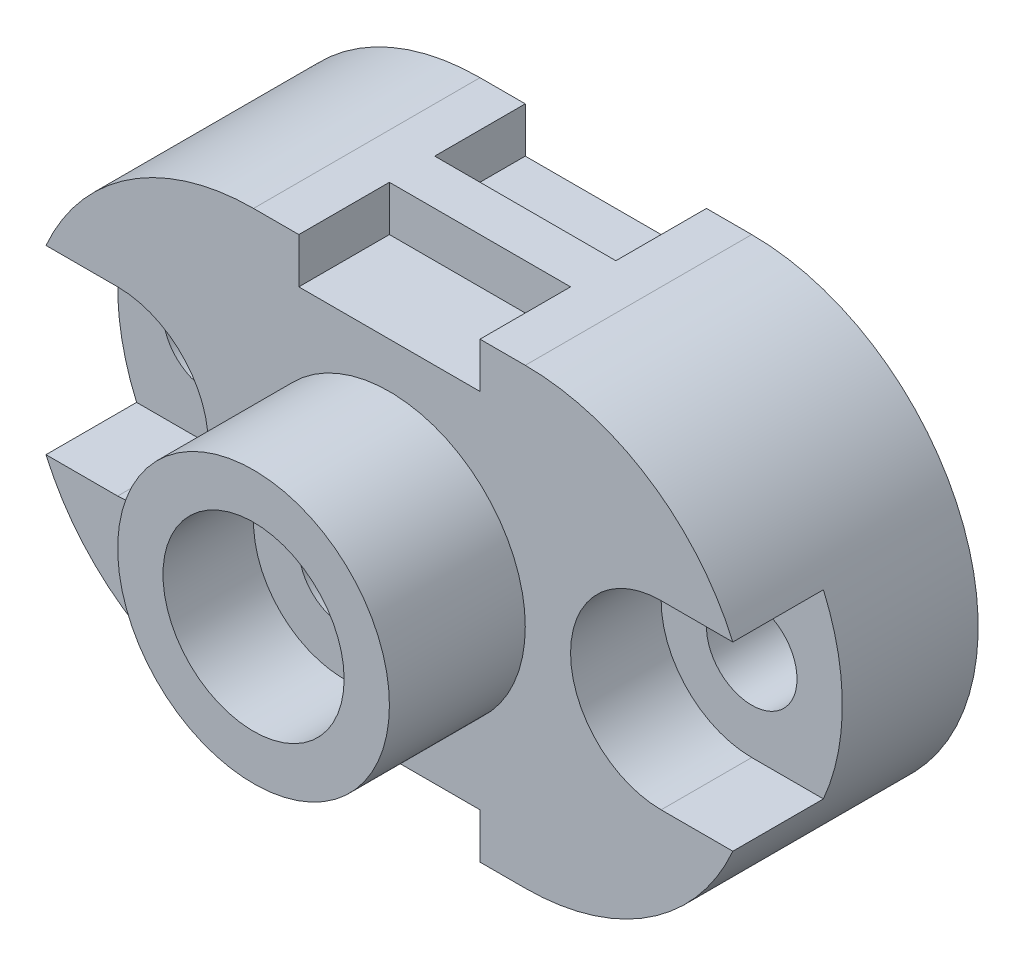
ISO-10303-21;
HEADER;
FILE_DESCRIPTION(('STEP AP214'),'2;1');
FILE_NAME('part.step','',(''),(''),'','','');
FILE_SCHEMA(('AUTOMOTIVE_DESIGN { 1 0 10303 214 1 1 1 1 }'));
ENDSEC;
DATA;
#1=APPLICATION_CONTEXT('core data for automotive mechanical design processes');
#2=APPLICATION_PROTOCOL_DEFINITION('international standard','automotive_design',2000,#1);
#3=PRODUCT_CONTEXT('',#1,'mechanical');
#4=PRODUCT('Part','Part','',(#3));
#5=PRODUCT_RELATED_PRODUCT_CATEGORY('part','',(#4));
#6=PRODUCT_DEFINITION_FORMATION('','',#4);
#7=PRODUCT_DEFINITION_CONTEXT('part definition',#1,'design');
#8=PRODUCT_DEFINITION('design','',#6,#7);
#9=PRODUCT_DEFINITION_SHAPE('','',#8);
#10=(LENGTH_UNIT() NAMED_UNIT(*) SI_UNIT(.MILLI.,.METRE.));
#11=(NAMED_UNIT(*) PLANE_ANGLE_UNIT() SI_UNIT($,.RADIAN.));
#12=(NAMED_UNIT(*) SI_UNIT($,.STERADIAN.) SOLID_ANGLE_UNIT());
#13=UNCERTAINTY_MEASURE_WITH_UNIT(LENGTH_MEASURE(1.E-05),#10,'distance_accuracy_value','');
#14=(GEOMETRIC_REPRESENTATION_CONTEXT(3) GLOBAL_UNCERTAINTY_ASSIGNED_CONTEXT((#13)) GLOBAL_UNIT_ASSIGNED_CONTEXT((#10,
#11,#12)) REPRESENTATION_CONTEXT('',''));
#15=CARTESIAN_POINT('',(0.,0.,0.));
#16=DIRECTION('',(0.,0.,1.));
#17=DIRECTION('',(1.,0.,0.));
#18=AXIS2_PLACEMENT_3D('',#15,#16,#17);
#19=CARTESIAN_POINT('',(0.,0.,50.));
#20=DIRECTION('',(0.,0.,1.));
#21=DIRECTION('',(1.,0.,0.));
#22=AXIS2_PLACEMENT_3D('',#19,#20,#21);
#23=PLANE('',#22);
#24=CARTESIAN_POINT('',(30.,0.,50.));
#25=DIRECTION('',(0.,0.,1.));
#26=DIRECTION('',(1.,0.,0.));
#27=AXIS2_PLACEMENT_3D('',#24,#25,#26);
#28=CIRCLE('',#27,30.);
#29=CARTESIAN_POINT('',(60.,0.,50.));
#30=VERTEX_POINT('',#29);
#31=EDGE_CURVE('E407',#30,#30,#28,.T.);
#32=ORIENTED_EDGE('',*,*,#31,.F.);
#33=EDGE_LOOP('',(#32));
#34=FACE_BOUND('',#33,.T.);
#35=CARTESIAN_POINT('',(90.,0.,50.));
#36=DIRECTION('',(0.,0.,1.));
#37=DIRECTION('',(1.,0.,0.));
#38=AXIS2_PLACEMENT_3D('',#35,#36,#37);
#39=CIRCLE('',#38,20.);
#40=CARTESIAN_POINT('',(90.,20.,50.));
#41=VERTEX_POINT('',#40);
#42=CARTESIAN_POINT('',(90.,-20.,50.));
#43=VERTEX_POINT('',#42);
#44=EDGE_CURVE('E249',#41,#43,#39,.T.);
#45=ORIENTED_EDGE('',*,*,#44,.F.);
#46=DIRECTION('',(1.,0.,0.));
#47=VECTOR('',#46,1.);
#48=CARTESIAN_POINT('',(0.,20.,50.));
#49=LINE('',#48,#47);
#50=CARTESIAN_POINT('',(105.825756949558,20.,50.));
#51=VERTEX_POINT('',#50);
#52=EDGE_CURVE('E228',#41,#51,#49,.T.);
#53=ORIENTED_EDGE('',*,*,#52,.T.);
#54=CARTESIAN_POINT('',(60.,0.,50.));
#55=DIRECTION('',(0.,0.,1.));
#56=DIRECTION('',(-1.,0.,0.));
#57=AXIS2_PLACEMENT_3D('',#54,#55,#56);
#58=CIRCLE('',#57,50.);
#59=CARTESIAN_POINT('',(60.,50.,50.));
#60=VERTEX_POINT('',#59);
#61=EDGE_CURVE('E428',#51,#60,#58,.T.);
#62=ORIENTED_EDGE('',*,*,#61,.T.);
#63=DIRECTION('',(-1.,0.,0.));
#64=VECTOR('',#63,1.);
#65=CARTESIAN_POINT('',(0.,50.,50.));
#66=LINE('',#65,#64);
#67=CARTESIAN_POINT('',(50.,50.,50.));
#68=VERTEX_POINT('',#67);
#69=EDGE_CURVE('E433',#60,#68,#66,.T.);
#70=ORIENTED_EDGE('',*,*,#69,.T.);
#71=DIRECTION('',(0.,1.,0.));
#72=VECTOR('',#71,1.);
#73=CARTESIAN_POINT('',(50.,50.,50.));
#74=LINE('',#73,#72);
#75=CARTESIAN_POINT('',(50.,40.,50.));
#76=VERTEX_POINT('',#75);
#77=EDGE_CURVE('E369',#76,#68,#74,.T.);
#78=ORIENTED_EDGE('',*,*,#77,.F.);
#79=DIRECTION('',(1.,0.,0.));
#80=VECTOR('',#79,1.);
#81=CARTESIAN_POINT('',(50.,40.,50.));
#82=LINE('',#81,#80);
#83=CARTESIAN_POINT('',(10.,40.,50.));
#84=VERTEX_POINT('',#83);
#85=EDGE_CURVE('E379',#84,#76,#82,.T.);
#86=ORIENTED_EDGE('',*,*,#85,.F.);
#87=DIRECTION('',(0.,-1.,0.));
#88=VECTOR('',#87,1.);
#89=CARTESIAN_POINT('',(10.,50.,50.));
#90=LINE('',#89,#88);
#91=CARTESIAN_POINT('',(10.,50.,50.));
#92=VERTEX_POINT('',#91);
#93=EDGE_CURVE('E390',#92,#84,#90,.T.);
#94=ORIENTED_EDGE('',*,*,#93,.F.);
#95=CARTESIAN_POINT('',(0.,50.,50.));
#96=VERTEX_POINT('',#95);
#97=EDGE_CURVE('E432',#92,#96,#66,.T.);
#98=ORIENTED_EDGE('',*,*,#97,.T.);
#99=CARTESIAN_POINT('',(0.,0.,50.));
#100=DIRECTION('',(0.,0.,1.));
#101=DIRECTION('',(1.,0.,0.));
#102=AXIS2_PLACEMENT_3D('',#99,#100,#101);
#103=CIRCLE('',#102,50.);
#104=CARTESIAN_POINT('',(-45.8257569495584,20.,50.));
#105=VERTEX_POINT('',#104);
#106=EDGE_CURVE('E420',#96,#105,#103,.T.);
#107=ORIENTED_EDGE('',*,*,#106,.T.);
#108=DIRECTION('',(-1.,0.,0.));
#109=VECTOR('',#108,1.);
#110=CARTESIAN_POINT('',(0.,20.,50.));
#111=LINE('',#110,#109);
#112=CARTESIAN_POINT('',(-30.,20.,50.));
#113=VERTEX_POINT('',#112);
#114=EDGE_CURVE('E275',#113,#105,#111,.T.);
#115=ORIENTED_EDGE('',*,*,#114,.F.);
#116=CARTESIAN_POINT('',(-30.,0.,50.));
#117=DIRECTION('',(0.,0.,1.));
#118=DIRECTION('',(1.,0.,0.));
#119=AXIS2_PLACEMENT_3D('',#116,#117,#118);
#120=CIRCLE('',#119,20.);
#121=CARTESIAN_POINT('',(-30.,-20.,50.));
#122=VERTEX_POINT('',#121);
#123=EDGE_CURVE('E255',#113,#122,#120,.F.);
#124=ORIENTED_EDGE('',*,*,#123,.T.);
#125=DIRECTION('',(-1.,0.,0.));
#126=VECTOR('',#125,1.);
#127=CARTESIAN_POINT('',(0.,-20.,50.));
#128=LINE('',#127,#126);
#129=CARTESIAN_POINT('',(-45.8257569495584,-20.,50.));
#130=VERTEX_POINT('',#129);
#131=EDGE_CURVE('E263',#122,#130,#128,.T.);
#132=ORIENTED_EDGE('',*,*,#131,.T.);
#133=CARTESIAN_POINT('',(0.,-50.,50.));
#134=VERTEX_POINT('',#133);
#135=EDGE_CURVE('E424',#130,#134,#103,.T.);
#136=ORIENTED_EDGE('',*,*,#135,.T.);
#137=DIRECTION('',(1.,0.,0.));
#138=VECTOR('',#137,1.);
#139=CARTESIAN_POINT('',(0.,-50.,50.));
#140=LINE('',#139,#138);
#141=CARTESIAN_POINT('',(10.,-50.,50.));
#142=VERTEX_POINT('',#141);
#143=EDGE_CURVE('E425',#134,#142,#140,.T.);
#144=ORIENTED_EDGE('',*,*,#143,.T.);
#145=DIRECTION('',(0.,-1.,0.));
#146=VECTOR('',#145,1.);
#147=CARTESIAN_POINT('',(10.,-50.,50.));
#148=LINE('',#147,#146);
#149=CARTESIAN_POINT('',(10.,-40.,50.));
#150=VERTEX_POINT('',#149);
#151=EDGE_CURVE('E323',#150,#142,#148,.T.);
#152=ORIENTED_EDGE('',*,*,#151,.F.);
#153=DIRECTION('',(-1.,0.,0.));
#154=VECTOR('',#153,1.);
#155=CARTESIAN_POINT('',(50.,-40.,50.));
#156=LINE('',#155,#154);
#157=CARTESIAN_POINT('',(50.,-40.,50.));
#158=VERTEX_POINT('',#157);
#159=EDGE_CURVE('E334',#158,#150,#156,.T.);
#160=ORIENTED_EDGE('',*,*,#159,.F.);
#161=DIRECTION('',(0.,1.,0.));
#162=VECTOR('',#161,1.);
#163=CARTESIAN_POINT('',(50.,-50.,50.));
#164=LINE('',#163,#162);
#165=CARTESIAN_POINT('',(50.,-50.,50.));
#166=VERTEX_POINT('',#165);
#167=EDGE_CURVE('E311',#166,#158,#164,.T.);
#168=ORIENTED_EDGE('',*,*,#167,.F.);
#169=CARTESIAN_POINT('',(60.,-50.,50.));
#170=VERTEX_POINT('',#169);
#171=EDGE_CURVE('E423',#166,#170,#140,.T.);
#172=ORIENTED_EDGE('',*,*,#171,.T.);
#173=CARTESIAN_POINT('',(105.825756949558,-20.,50.));
#174=VERTEX_POINT('',#173);
#175=EDGE_CURVE('E429',#170,#174,#58,.T.);
#176=ORIENTED_EDGE('',*,*,#175,.T.);
#177=DIRECTION('',(1.,0.,0.));
#178=VECTOR('',#177,1.);
#179=CARTESIAN_POINT('',(0.,-20.,50.));
#180=LINE('',#179,#178);
#181=EDGE_CURVE('E251',#43,#174,#180,.T.);
#182=ORIENTED_EDGE('',*,*,#181,.F.);
#183=EDGE_LOOP('',(#45,#53,#62,#70,#78,#86,#94,#98,#107,#115,#124,#132,#136,#144,#152,#160,#168,
#172,#176,#182));
#184=FACE_BOUND('',#183,.T.);
#185=ADVANCED_FACE('F33',(#34,#184),#23,.T.);
#186=CARTESIAN_POINT('',(60.,0.,50.));
#187=DIRECTION('',(0.,0.,-1.));
#188=DIRECTION('',(-1.,0.,0.));
#189=AXIS2_PLACEMENT_3D('',#186,#187,#188);
#190=CYLINDRICAL_SURFACE('',#189,50.);
#191=DIRECTION('',(0.,0.,1.));
#192=VECTOR('',#191,1.);
#193=CARTESIAN_POINT('',(105.825756949558,20.,30.));
#194=LINE('',#193,#192);
#195=CARTESIAN_POINT('',(105.825756949558,20.,30.));
#196=VERTEX_POINT('',#195);
#197=EDGE_CURVE('E253',#196,#51,#194,.T.);
#198=ORIENTED_EDGE('',*,*,#197,.F.);
#199=CARTESIAN_POINT('',(60.,0.,30.));
#200=DIRECTION('',(0.,0.,1.));
#201=DIRECTION('',(1.,0.,0.));
#202=AXIS2_PLACEMENT_3D('',#199,#200,#201);
#203=CIRCLE('',#202,50.);
#204=CARTESIAN_POINT('',(105.825756949558,-20.,30.));
#205=VERTEX_POINT('',#204);
#206=EDGE_CURVE('E234',#205,#196,#203,.T.);
#207=ORIENTED_EDGE('',*,*,#206,.F.);
#208=DIRECTION('',(0.,0.,1.));
#209=VECTOR('',#208,1.);
#210=CARTESIAN_POINT('',(105.825756949558,-20.,30.));
#211=LINE('',#210,#209);
#212=EDGE_CURVE('E256',#205,#174,#211,.T.);
#213=ORIENTED_EDGE('',*,*,#212,.T.);
#214=ORIENTED_EDGE('',*,*,#175,.F.);
#215=DIRECTION('',(0.,0.,-1.));
#216=VECTOR('',#215,1.);
#217=CARTESIAN_POINT('',(60.,-50.,50.));
#218=LINE('',#217,#216);
#219=CARTESIAN_POINT('',(60.,-50.,0.));
#220=VERTEX_POINT('',#219);
#221=EDGE_CURVE('E42',#170,#220,#218,.T.);
#222=ORIENTED_EDGE('',*,*,#221,.T.);
#223=CARTESIAN_POINT('',(60.,0.,0.));
#224=DIRECTION('',(0.,0.,1.));
#225=DIRECTION('',(-1.,0.,0.));
#226=AXIS2_PLACEMENT_3D('',#223,#224,#225);
#227=CIRCLE('',#226,50.);
#228=CARTESIAN_POINT('',(60.,50.,0.));
#229=VERTEX_POINT('',#228);
#230=EDGE_CURVE('E443',#220,#229,#227,.T.);
#231=ORIENTED_EDGE('',*,*,#230,.T.);
#232=DIRECTION('',(0.,0.,-1.));
#233=VECTOR('',#232,1.);
#234=CARTESIAN_POINT('',(60.,50.,50.));
#235=LINE('',#234,#233);
#236=EDGE_CURVE('E451',#60,#229,#235,.T.);
#237=ORIENTED_EDGE('',*,*,#236,.F.);
#238=ORIENTED_EDGE('',*,*,#61,.F.);
#239=EDGE_LOOP('',(#198,#207,#213,#214,#222,#231,#237,#238));
#240=FACE_BOUND('',#239,.T.);
#241=ADVANCED_FACE('F468',(#240),#190,.T.);
#242=CARTESIAN_POINT('',(90.,0.,-9.99999999999999));
#243=DIRECTION('',(0.,0.,1.));
#244=DIRECTION('',(1.,0.,0.));
#245=AXIS2_PLACEMENT_3D('',#242,#243,#244);
#246=CYLINDRICAL_SURFACE('',#245,9.99999999999999);
#247=CARTESIAN_POINT('',(90.,0.,0.));
#248=DIRECTION('',(0.,0.,1.));
#249=DIRECTION('',(1.,0.,0.));
#250=AXIS2_PLACEMENT_3D('',#247,#248,#249);
#251=CIRCLE('',#250,9.99999999999999);
#252=CARTESIAN_POINT('',(100.,0.,0.));
#253=VERTEX_POINT('',#252);
#254=EDGE_CURVE('E37',#253,#253,#251,.T.);
#255=ORIENTED_EDGE('',*,*,#254,.F.);
#256=EDGE_LOOP('',(#255));
#257=FACE_BOUND('',#256,.T.);
#258=CARTESIAN_POINT('',(90.,0.,30.));
#259=DIRECTION('',(0.,0.,1.));
#260=DIRECTION('',(1.,0.,0.));
#261=AXIS2_PLACEMENT_3D('',#258,#259,#260);
#262=CIRCLE('',#261,9.99999999999999);
#263=CARTESIAN_POINT('',(100.,0.,30.));
#264=VERTEX_POINT('',#263);
#265=EDGE_CURVE('E240',#264,#264,#262,.F.);
#266=ORIENTED_EDGE('',*,*,#265,.F.);
#267=EDGE_LOOP('',(#266));
#268=FACE_BOUND('',#267,.T.);
#269=ADVANCED_FACE('F465',(#257,#268),#246,.F.);
#270=CARTESIAN_POINT('',(0.,0.,50.));
#271=DIRECTION('',(0.,0.,-1.));
#272=DIRECTION('',(-1.,0.,0.));
#273=AXIS2_PLACEMENT_3D('',#270,#271,#272);
#274=CYLINDRICAL_SURFACE('',#273,50.);
#275=DIRECTION('',(0.,0.,1.));
#276=VECTOR('',#275,1.);
#277=CARTESIAN_POINT('',(-45.8257569495584,-20.,30.));
#278=LINE('',#277,#276);
#279=CARTESIAN_POINT('',(-45.8257569495584,-20.,30.));
#280=VERTEX_POINT('',#279);
#281=EDGE_CURVE('E282',#280,#130,#278,.T.);
#282=ORIENTED_EDGE('',*,*,#281,.F.);
#283=CARTESIAN_POINT('',(0.,0.,30.));
#284=DIRECTION('',(0.,0.,1.));
#285=DIRECTION('',(1.,0.,0.));
#286=AXIS2_PLACEMENT_3D('',#283,#284,#285);
#287=CIRCLE('',#286,50.);
#288=CARTESIAN_POINT('',(-45.8257569495584,20.,30.));
#289=VERTEX_POINT('',#288);
#290=EDGE_CURVE('E265',#289,#280,#287,.T.);
#291=ORIENTED_EDGE('',*,*,#290,.F.);
#292=DIRECTION('',(0.,0.,1.));
#293=VECTOR('',#292,1.);
#294=CARTESIAN_POINT('',(-45.8257569495584,20.,30.));
#295=LINE('',#294,#293);
#296=EDGE_CURVE('E284',#289,#105,#295,.T.);
#297=ORIENTED_EDGE('',*,*,#296,.T.);
#298=ORIENTED_EDGE('',*,*,#106,.F.);
#299=DIRECTION('',(0.,0.,-1.));
#300=VECTOR('',#299,1.);
#301=CARTESIAN_POINT('',(0.,50.,50.));
#302=LINE('',#301,#300);
#303=CARTESIAN_POINT('',(0.,50.,0.));
#304=VERTEX_POINT('',#303);
#305=EDGE_CURVE('E436',#96,#304,#302,.T.);
#306=ORIENTED_EDGE('',*,*,#305,.T.);
#307=CARTESIAN_POINT('',(0.,0.,0.));
#308=DIRECTION('',(0.,0.,1.));
#309=DIRECTION('',(1.,0.,0.));
#310=AXIS2_PLACEMENT_3D('',#307,#308,#309);
#311=CIRCLE('',#310,50.);
#312=CARTESIAN_POINT('',(0.,-50.,0.));
#313=VERTEX_POINT('',#312);
#314=EDGE_CURVE('E419',#304,#313,#311,.T.);
#315=ORIENTED_EDGE('',*,*,#314,.T.);
#316=DIRECTION('',(0.,0.,-1.));
#317=VECTOR('',#316,1.);
#318=CARTESIAN_POINT('',(0.,-50.,50.));
#319=LINE('',#318,#317);
#320=EDGE_CURVE('E11',#134,#313,#319,.T.);
#321=ORIENTED_EDGE('',*,*,#320,.F.);
#322=ORIENTED_EDGE('',*,*,#135,.F.);
#323=EDGE_LOOP('',(#282,#291,#297,#298,#306,#315,#321,#322));
#324=FACE_BOUND('',#323,.T.);
#325=ADVANCED_FACE('F35',(#324),#274,.T.);
#326=CARTESIAN_POINT('',(-30.,0.,-9.99999999999999));
#327=DIRECTION('',(0.,0.,1.));
#328=DIRECTION('',(1.,0.,0.));
#329=AXIS2_PLACEMENT_3D('',#326,#327,#328);
#330=CYLINDRICAL_SURFACE('',#329,10.);
#331=CARTESIAN_POINT('',(-30.,0.,0.));
#332=DIRECTION('',(0.,0.,1.));
#333=DIRECTION('',(1.,0.,0.));
#334=AXIS2_PLACEMENT_3D('',#331,#332,#333);
#335=CIRCLE('',#334,10.);
#336=CARTESIAN_POINT('',(-20.,0.,0.));
#337=VERTEX_POINT('',#336);
#338=EDGE_CURVE('E305',#337,#337,#335,.T.);
#339=ORIENTED_EDGE('',*,*,#338,.F.);
#340=EDGE_LOOP('',(#339));
#341=FACE_BOUND('',#340,.T.);
#342=CARTESIAN_POINT('',(-30.,0.,30.));
#343=DIRECTION('',(0.,0.,1.));
#344=DIRECTION('',(1.,0.,0.));
#345=AXIS2_PLACEMENT_3D('',#342,#343,#344);
#346=CIRCLE('',#345,10.);
#347=CARTESIAN_POINT('',(-20.,0.,30.));
#348=VERTEX_POINT('',#347);
#349=EDGE_CURVE('E269',#348,#348,#346,.F.);
#350=ORIENTED_EDGE('',*,*,#349,.F.);
#351=EDGE_LOOP('',(#350));
#352=FACE_BOUND('',#351,.T.);
#353=ADVANCED_FACE('F502',(#341,#352),#330,.F.);
#354=CARTESIAN_POINT('',(0.,-50.,50.));
#355=DIRECTION('',(0.,1.,0.));
#356=DIRECTION('',(0.,0.,1.));
#357=AXIS2_PLACEMENT_3D('',#354,#355,#356);
#358=PLANE('',#357);
#359=DIRECTION('',(1.,0.,0.));
#360=VECTOR('',#359,1.);
#361=CARTESIAN_POINT('',(0.,-50.,0.));
#362=LINE('',#361,#360);
#363=CARTESIAN_POINT('',(10.,-50.,0.));
#364=VERTEX_POINT('',#363);
#365=EDGE_CURVE('E440',#313,#364,#362,.T.);
#366=ORIENTED_EDGE('',*,*,#365,.T.);
#367=DIRECTION('',(0.,0.,-1.));
#368=VECTOR('',#367,1.);
#369=CARTESIAN_POINT('',(10.,-50.,20.));
#370=LINE('',#369,#368);
#371=CARTESIAN_POINT('',(10.,-50.,20.));
#372=VERTEX_POINT('',#371);
#373=EDGE_CURVE('E309',#372,#364,#370,.T.);
#374=ORIENTED_EDGE('',*,*,#373,.F.);
#375=DIRECTION('',(-1.,0.,0.));
#376=VECTOR('',#375,1.);
#377=CARTESIAN_POINT('',(10.,-50.,20.));
#378=LINE('',#377,#376);
#379=CARTESIAN_POINT('',(50.,-50.,20.));
#380=VERTEX_POINT('',#379);
#381=EDGE_CURVE('E298',#380,#372,#378,.T.);
#382=ORIENTED_EDGE('',*,*,#381,.F.);
#383=DIRECTION('',(0.,0.,-1.));
#384=VECTOR('',#383,1.);
#385=CARTESIAN_POINT('',(50.,-50.,20.));
#386=LINE('',#385,#384);
#387=CARTESIAN_POINT('',(50.,-50.,0.));
#388=VERTEX_POINT('',#387);
#389=EDGE_CURVE('E312',#380,#388,#386,.T.);
#390=ORIENTED_EDGE('',*,*,#389,.T.);
#391=EDGE_CURVE('E439',#388,#220,#362,.T.);
#392=ORIENTED_EDGE('',*,*,#391,.T.);
#393=ORIENTED_EDGE('',*,*,#221,.F.);
#394=ORIENTED_EDGE('',*,*,#171,.F.);
#395=DIRECTION('',(0.,0.,1.));
#396=VECTOR('',#395,1.);
#397=CARTESIAN_POINT('',(50.,-50.,30.));
#398=LINE('',#397,#396);
#399=CARTESIAN_POINT('',(50.,-50.,30.));
#400=VERTEX_POINT('',#399);
#401=EDGE_CURVE('E338',#400,#166,#398,.T.);
#402=ORIENTED_EDGE('',*,*,#401,.F.);
#403=DIRECTION('',(1.,0.,0.));
#404=VECTOR('',#403,1.);
#405=CARTESIAN_POINT('',(50.,-50.,30.));
#406=LINE('',#405,#404);
#407=CARTESIAN_POINT('',(10.,-50.,30.));
#408=VERTEX_POINT('',#407);
#409=EDGE_CURVE('E328',#408,#400,#406,.T.);
#410=ORIENTED_EDGE('',*,*,#409,.F.);
#411=DIRECTION('',(0.,0.,1.));
#412=VECTOR('',#411,1.);
#413=CARTESIAN_POINT('',(10.,-50.,30.));
#414=LINE('',#413,#412);
#415=EDGE_CURVE('E341',#408,#142,#414,.T.);
#416=ORIENTED_EDGE('',*,*,#415,.T.);
#417=ORIENTED_EDGE('',*,*,#143,.F.);
#418=ORIENTED_EDGE('',*,*,#320,.T.);
#419=EDGE_LOOP('',(#366,#374,#382,#390,#392,#393,#394,#402,#410,#416,#417,#418));
#420=FACE_BOUND('',#419,.T.);
#421=ADVANCED_FACE('F499',(#420),#358,.F.);
#422=CARTESIAN_POINT('',(0.,50.,50.));
#423=DIRECTION('',(0.,-1.,0.));
#424=DIRECTION('',(0.,0.,-1.));
#425=AXIS2_PLACEMENT_3D('',#422,#423,#424);
#426=PLANE('',#425);
#427=DIRECTION('',(1.,0.,0.));
#428=VECTOR('',#427,1.);
#429=CARTESIAN_POINT('',(9.99999999999999,50.,20.));
#430=LINE('',#429,#428);
#431=CARTESIAN_POINT('',(9.99999999999999,50.,20.));
#432=VERTEX_POINT('',#431);
#433=CARTESIAN_POINT('',(50.,50.,20.));
#434=VERTEX_POINT('',#433);
#435=EDGE_CURVE('E350',#432,#434,#430,.T.);
#436=ORIENTED_EDGE('',*,*,#435,.F.);
#437=DIRECTION('',(0.,0.,-1.));
#438=VECTOR('',#437,1.);
#439=CARTESIAN_POINT('',(9.99999999999999,50.,20.));
#440=LINE('',#439,#438);
#441=CARTESIAN_POINT('',(9.99999999999999,50.,0.));
#442=VERTEX_POINT('',#441);
#443=EDGE_CURVE('E360',#432,#442,#440,.T.);
#444=ORIENTED_EDGE('',*,*,#443,.T.);
#445=DIRECTION('',(-1.,0.,0.));
#446=VECTOR('',#445,1.);
#447=CARTESIAN_POINT('',(0.,50.,0.));
#448=LINE('',#447,#446);
#449=EDGE_CURVE('E445',#442,#304,#448,.T.);
#450=ORIENTED_EDGE('',*,*,#449,.T.);
#451=ORIENTED_EDGE('',*,*,#305,.F.);
#452=ORIENTED_EDGE('',*,*,#97,.F.);
#453=DIRECTION('',(0.,0.,1.));
#454=VECTOR('',#453,1.);
#455=CARTESIAN_POINT('',(10.,50.,30.));
#456=LINE('',#455,#454);
#457=CARTESIAN_POINT('',(10.,50.,30.));
#458=VERTEX_POINT('',#457);
#459=EDGE_CURVE('E400',#458,#92,#456,.T.);
#460=ORIENTED_EDGE('',*,*,#459,.F.);
#461=DIRECTION('',(-1.,0.,0.));
#462=VECTOR('',#461,1.);
#463=CARTESIAN_POINT('',(50.,50.,30.));
#464=LINE('',#463,#462);
#465=CARTESIAN_POINT('',(50.,50.,30.));
#466=VERTEX_POINT('',#465);
#467=EDGE_CURVE('E378',#466,#458,#464,.T.);
#468=ORIENTED_EDGE('',*,*,#467,.F.);
#469=DIRECTION('',(0.,0.,1.));
#470=VECTOR('',#469,1.);
#471=CARTESIAN_POINT('',(50.,50.,30.));
#472=LINE('',#471,#470);
#473=EDGE_CURVE('E388',#466,#68,#472,.T.);
#474=ORIENTED_EDGE('',*,*,#473,.T.);
#475=ORIENTED_EDGE('',*,*,#69,.F.);
#476=ORIENTED_EDGE('',*,*,#236,.T.);
#477=CARTESIAN_POINT('',(50.,50.,0.));
#478=VERTEX_POINT('',#477);
#479=EDGE_CURVE('E446',#229,#478,#448,.T.);
#480=ORIENTED_EDGE('',*,*,#479,.T.);
#481=DIRECTION('',(0.,0.,-1.));
#482=VECTOR('',#481,1.);
#483=CARTESIAN_POINT('',(50.,50.,20.));
#484=LINE('',#483,#482);
#485=EDGE_CURVE('E372',#434,#478,#484,.T.);
#486=ORIENTED_EDGE('',*,*,#485,.F.);
#487=EDGE_LOOP('',(#436,#444,#450,#451,#452,#460,#468,#474,#475,#476,#480,#486));
#488=FACE_BOUND('',#487,.T.);
#489=ADVANCED_FACE('F497',(#488),#426,.F.);
#490=CARTESIAN_POINT('',(0.,0.,0.));
#491=DIRECTION('',(0.,0.,1.));
#492=DIRECTION('',(1.,0.,0.));
#493=AXIS2_PLACEMENT_3D('',#490,#491,#492);
#494=PLANE('',#493);
#495=ORIENTED_EDGE('',*,*,#254,.T.);
#496=EDGE_LOOP('',(#495));
#497=FACE_BOUND('',#496,.T.);
#498=ORIENTED_EDGE('',*,*,#338,.T.);
#499=EDGE_LOOP('',(#498));
#500=FACE_BOUND('',#499,.T.);
#501=CARTESIAN_POINT('',(30.,0.,0.));
#502=DIRECTION('',(0.,0.,1.));
#503=DIRECTION('',(1.,0.,0.));
#504=AXIS2_PLACEMENT_3D('',#501,#502,#503);
#505=CIRCLE('',#504,10.);
#506=CARTESIAN_POINT('',(40.,0.,0.));
#507=VERTEX_POINT('',#506);
#508=EDGE_CURVE('E414',#507,#507,#505,.T.);
#509=ORIENTED_EDGE('',*,*,#508,.T.);
#510=EDGE_LOOP('',(#509));
#511=FACE_BOUND('',#510,.T.);
#512=DIRECTION('',(1.,0.,0.));
#513=VECTOR('',#512,1.);
#514=CARTESIAN_POINT('',(10.,-40.,0.));
#515=LINE('',#514,#513);
#516=CARTESIAN_POINT('',(10.,-40.,0.));
#517=VERTEX_POINT('',#516);
#518=CARTESIAN_POINT('',(50.,-40.,0.));
#519=VERTEX_POINT('',#518);
#520=EDGE_CURVE('E304',#517,#519,#515,.T.);
#521=ORIENTED_EDGE('',*,*,#520,.F.);
#522=DIRECTION('',(0.,1.,0.));
#523=VECTOR('',#522,1.);
#524=CARTESIAN_POINT('',(10.,-50.,0.));
#525=LINE('',#524,#523);
#526=EDGE_CURVE('E302',#364,#517,#525,.T.);
#527=ORIENTED_EDGE('',*,*,#526,.F.);
#528=ORIENTED_EDGE('',*,*,#365,.F.);
#529=ORIENTED_EDGE('',*,*,#314,.F.);
#530=ORIENTED_EDGE('',*,*,#449,.F.);
#531=DIRECTION('',(0.,1.,0.));
#532=VECTOR('',#531,1.);
#533=CARTESIAN_POINT('',(9.99999999999999,50.,0.));
#534=LINE('',#533,#532);
#535=CARTESIAN_POINT('',(9.99999999999999,40.,0.));
#536=VERTEX_POINT('',#535);
#537=EDGE_CURVE('E340',#536,#442,#534,.T.);
#538=ORIENTED_EDGE('',*,*,#537,.F.);
#539=DIRECTION('',(-1.,0.,0.));
#540=VECTOR('',#539,1.);
#541=CARTESIAN_POINT('',(9.99999999999999,40.,0.));
#542=LINE('',#541,#540);
#543=CARTESIAN_POINT('',(50.,40.,0.));
#544=VERTEX_POINT('',#543);
#545=EDGE_CURVE('E351',#544,#536,#542,.T.);
#546=ORIENTED_EDGE('',*,*,#545,.F.);
#547=DIRECTION('',(0.,-1.,0.));
#548=VECTOR('',#547,1.);
#549=CARTESIAN_POINT('',(50.,50.,0.));
#550=LINE('',#549,#548);
#551=EDGE_CURVE('E362',#478,#544,#550,.T.);
#552=ORIENTED_EDGE('',*,*,#551,.F.);
#553=ORIENTED_EDGE('',*,*,#479,.F.);
#554=ORIENTED_EDGE('',*,*,#230,.F.);
#555=ORIENTED_EDGE('',*,*,#391,.F.);
#556=DIRECTION('',(0.,-1.,0.));
#557=VECTOR('',#556,1.);
#558=CARTESIAN_POINT('',(50.,-50.,0.));
#559=LINE('',#558,#557);
#560=EDGE_CURVE('E292',#519,#388,#559,.T.);
#561=ORIENTED_EDGE('',*,*,#560,.F.);
#562=EDGE_LOOP('',(#521,#527,#528,#529,#530,#538,#546,#552,#553,#554,#555,#561));
#563=FACE_BOUND('',#562,.T.);
#564=ADVANCED_FACE('F463',(#497,#500,#511,#563),#494,.F.);
#565=CARTESIAN_POINT('',(30.,0.,0.));
#566=DIRECTION('',(0.,0.,1.));
#567=DIRECTION('',(1.,0.,0.));
#568=AXIS2_PLACEMENT_3D('',#565,#566,#567);
#569=CYLINDRICAL_SURFACE('',#568,10.);
#570=ORIENTED_EDGE('',*,*,#508,.F.);
#571=EDGE_LOOP('',(#570));
#572=FACE_BOUND('',#571,.T.);
#573=CARTESIAN_POINT('',(30.,0.,60.));
#574=DIRECTION('',(0.,0.,1.));
#575=DIRECTION('',(1.,0.,0.));
#576=AXIS2_PLACEMENT_3D('',#573,#574,#575);
#577=CIRCLE('',#576,10.);
#578=CARTESIAN_POINT('',(40.,0.,60.));
#579=VERTEX_POINT('',#578);
#580=EDGE_CURVE('E397',#579,#579,#577,.T.);
#581=ORIENTED_EDGE('',*,*,#580,.T.);
#582=EDGE_LOOP('',(#581));
#583=FACE_BOUND('',#582,.T.);
#584=ADVANCED_FACE('F493',(#572,#583),#569,.F.);
#585=CARTESIAN_POINT('',(30.,0.,80.));
#586=DIRECTION('',(0.,0.,-1.));
#587=DIRECTION('',(-1.,0.,0.));
#588=AXIS2_PLACEMENT_3D('',#585,#586,#587);
#589=CYLINDRICAL_SURFACE('',#588,30.);
#590=CARTESIAN_POINT('',(30.,0.,80.));
#591=DIRECTION('',(0.,0.,1.));
#592=DIRECTION('',(1.,0.,0.));
#593=AXIS2_PLACEMENT_3D('',#590,#591,#592);
#594=CIRCLE('',#593,30.);
#595=CARTESIAN_POINT('',(60.,0.,80.));
#596=VERTEX_POINT('',#595);
#597=EDGE_CURVE('E411',#596,#596,#594,.T.);
#598=ORIENTED_EDGE('',*,*,#597,.F.);
#599=EDGE_LOOP('',(#598));
#600=FACE_BOUND('',#599,.T.);
#601=ORIENTED_EDGE('',*,*,#31,.T.);
#602=EDGE_LOOP('',(#601));
#603=FACE_BOUND('',#602,.T.);
#604=ADVANCED_FACE('F620',(#600,#603),#589,.T.);
#605=CARTESIAN_POINT('',(30.,0.,80.));
#606=DIRECTION('',(0.,0.,1.));
#607=DIRECTION('',(1.,0.,0.));
#608=AXIS2_PLACEMENT_3D('',#605,#606,#607);
#609=PLANE('',#608);
#610=CARTESIAN_POINT('',(30.,0.,80.));
#611=DIRECTION('',(0.,0.,1.));
#612=DIRECTION('',(1.,0.,0.));
#613=AXIS2_PLACEMENT_3D('',#610,#611,#612);
#614=CIRCLE('',#613,20.);
#615=CARTESIAN_POINT('',(50.,0.,80.));
#616=VERTEX_POINT('',#615);
#617=EDGE_CURVE('E408',#616,#616,#614,.T.);
#618=ORIENTED_EDGE('',*,*,#617,.F.);
#619=EDGE_LOOP('',(#618));
#620=FACE_BOUND('',#619,.T.);
#621=ORIENTED_EDGE('',*,*,#597,.T.);
#622=EDGE_LOOP('',(#621));
#623=FACE_BOUND('',#622,.T.);
#624=ADVANCED_FACE('F617',(#620,#623),#609,.T.);
#625=CARTESIAN_POINT('',(30.,0.,60.));
#626=DIRECTION('',(0.,0.,1.));
#627=DIRECTION('',(1.,0.,0.));
#628=AXIS2_PLACEMENT_3D('',#625,#626,#627);
#629=CYLINDRICAL_SURFACE('',#628,20.);
#630=CARTESIAN_POINT('',(30.,0.,60.));
#631=DIRECTION('',(0.,0.,1.));
#632=DIRECTION('',(1.,0.,0.));
#633=AXIS2_PLACEMENT_3D('',#630,#631,#632);
#634=CIRCLE('',#633,20.);
#635=CARTESIAN_POINT('',(50.,0.,60.));
#636=VERTEX_POINT('',#635);
#637=EDGE_CURVE('E404',#636,#636,#634,.T.);
#638=ORIENTED_EDGE('',*,*,#637,.F.);
#639=EDGE_LOOP('',(#638));
#640=FACE_BOUND('',#639,.T.);
#641=ORIENTED_EDGE('',*,*,#617,.T.);
#642=EDGE_LOOP('',(#641));
#643=FACE_BOUND('',#642,.T.);
#644=ADVANCED_FACE('F613',(#640,#643),#629,.F.);
#645=CARTESIAN_POINT('',(30.,0.,60.));
#646=DIRECTION('',(0.,0.,1.));
#647=DIRECTION('',(1.,0.,0.));
#648=AXIS2_PLACEMENT_3D('',#645,#646,#647);
#649=PLANE('',#648);
#650=ORIENTED_EDGE('',*,*,#580,.F.);
#651=EDGE_LOOP('',(#650));
#652=FACE_BOUND('',#651,.T.);
#653=ORIENTED_EDGE('',*,*,#637,.T.);
#654=EDGE_LOOP('',(#653));
#655=FACE_BOUND('',#654,.T.);
#656=ADVANCED_FACE('F609',(#652,#655),#649,.T.);
#657=CARTESIAN_POINT('',(50.,50.,30.));
#658=DIRECTION('',(1.,0.,0.));
#659=DIRECTION('',(0.,0.,-1.));
#660=AXIS2_PLACEMENT_3D('',#657,#658,#659);
#661=PLANE('',#660);
#662=ORIENTED_EDGE('',*,*,#77,.T.);
#663=ORIENTED_EDGE('',*,*,#473,.F.);
#664=DIRECTION('',(0.,1.,0.));
#665=VECTOR('',#664,1.);
#666=CARTESIAN_POINT('',(50.,50.,30.));
#667=LINE('',#666,#665);
#668=CARTESIAN_POINT('',(50.,40.,30.));
#669=VERTEX_POINT('',#668);
#670=EDGE_CURVE('E376',#669,#466,#667,.T.);
#671=ORIENTED_EDGE('',*,*,#670,.F.);
#672=DIRECTION('',(0.,0.,1.));
#673=VECTOR('',#672,1.);
#674=CARTESIAN_POINT('',(50.,40.,30.));
#675=LINE('',#674,#673);
#676=EDGE_CURVE('E395',#669,#76,#675,.T.);
#677=ORIENTED_EDGE('',*,*,#676,.T.);
#678=EDGE_LOOP('',(#662,#663,#671,#677));
#679=FACE_BOUND('',#678,.T.);
#680=ADVANCED_FACE('F602',(#679),#661,.F.);
#681=CARTESIAN_POINT('',(50.,40.,30.));
#682=DIRECTION('',(0.,-1.,0.));
#683=DIRECTION('',(1.,0.,0.));
#684=AXIS2_PLACEMENT_3D('',#681,#682,#683);
#685=PLANE('',#684);
#686=ORIENTED_EDGE('',*,*,#85,.T.);
#687=ORIENTED_EDGE('',*,*,#676,.F.);
#688=DIRECTION('',(1.,0.,0.));
#689=VECTOR('',#688,1.);
#690=CARTESIAN_POINT('',(50.,40.,30.));
#691=LINE('',#690,#689);
#692=CARTESIAN_POINT('',(10.,40.,30.));
#693=VERTEX_POINT('',#692);
#694=EDGE_CURVE('E385',#693,#669,#691,.T.);
#695=ORIENTED_EDGE('',*,*,#694,.F.);
#696=DIRECTION('',(0.,0.,1.));
#697=VECTOR('',#696,1.);
#698=CARTESIAN_POINT('',(10.,40.,30.));
#699=LINE('',#698,#697);
#700=EDGE_CURVE('E398',#693,#84,#699,.T.);
#701=ORIENTED_EDGE('',*,*,#700,.T.);
#702=EDGE_LOOP('',(#686,#687,#695,#701));
#703=FACE_BOUND('',#702,.T.);
#704=ADVANCED_FACE('F599',(#703),#685,.F.);
#705=CARTESIAN_POINT('',(10.,50.,30.));
#706=DIRECTION('',(-1.,0.,0.));
#707=DIRECTION('',(0.,-1.,0.));
#708=AXIS2_PLACEMENT_3D('',#705,#706,#707);
#709=PLANE('',#708);
#710=ORIENTED_EDGE('',*,*,#93,.T.);
#711=ORIENTED_EDGE('',*,*,#700,.F.);
#712=DIRECTION('',(0.,-1.,0.));
#713=VECTOR('',#712,1.);
#714=CARTESIAN_POINT('',(10.,50.,30.));
#715=LINE('',#714,#713);
#716=EDGE_CURVE('E382',#458,#693,#715,.T.);
#717=ORIENTED_EDGE('',*,*,#716,.F.);
#718=ORIENTED_EDGE('',*,*,#459,.T.);
#719=EDGE_LOOP('',(#710,#711,#717,#718));
#720=FACE_BOUND('',#719,.T.);
#721=ADVANCED_FACE('F597',(#720),#709,.F.);
#722=CARTESIAN_POINT('',(0.,0.,30.));
#723=DIRECTION('',(0.,0.,-1.));
#724=DIRECTION('',(-1.,0.,0.));
#725=AXIS2_PLACEMENT_3D('',#722,#723,#724);
#726=PLANE('',#725);
#727=ORIENTED_EDGE('',*,*,#670,.T.);
#728=ORIENTED_EDGE('',*,*,#467,.T.);
#729=ORIENTED_EDGE('',*,*,#716,.T.);
#730=ORIENTED_EDGE('',*,*,#694,.T.);
#731=EDGE_LOOP('',(#727,#728,#729,#730));
#732=FACE_BOUND('',#731,.T.);
#733=ADVANCED_FACE('F594',(#732),#726,.F.);
#734=CARTESIAN_POINT('',(9.99999999999999,50.,20.));
#735=DIRECTION('',(-1.,0.,0.));
#736=DIRECTION('',(0.,-1.,0.));
#737=AXIS2_PLACEMENT_3D('',#734,#735,#736);
#738=PLANE('',#737);
#739=ORIENTED_EDGE('',*,*,#537,.T.);
#740=ORIENTED_EDGE('',*,*,#443,.F.);
#741=DIRECTION('',(0.,1.,0.));
#742=VECTOR('',#741,1.);
#743=CARTESIAN_POINT('',(9.99999999999999,50.,20.));
#744=LINE('',#743,#742);
#745=CARTESIAN_POINT('',(9.99999999999999,40.,20.));
#746=VERTEX_POINT('',#745);
#747=EDGE_CURVE('E347',#746,#432,#744,.T.);
#748=ORIENTED_EDGE('',*,*,#747,.F.);
#749=DIRECTION('',(0.,0.,-1.));
#750=VECTOR('',#749,1.);
#751=CARTESIAN_POINT('',(9.99999999999999,40.,20.));
#752=LINE('',#751,#750);
#753=EDGE_CURVE('E367',#746,#536,#752,.T.);
#754=ORIENTED_EDGE('',*,*,#753,.T.);
#755=EDGE_LOOP('',(#739,#740,#748,#754));
#756=FACE_BOUND('',#755,.T.);
#757=ADVANCED_FACE('F571',(#756),#738,.F.);
#758=CARTESIAN_POINT('',(9.99999999999999,40.,20.));
#759=DIRECTION('',(0.,-1.,0.));
#760=DIRECTION('',(1.,0.,0.));
#761=AXIS2_PLACEMENT_3D('',#758,#759,#760);
#762=PLANE('',#761);
#763=ORIENTED_EDGE('',*,*,#545,.T.);
#764=ORIENTED_EDGE('',*,*,#753,.F.);
#765=DIRECTION('',(-1.,0.,0.));
#766=VECTOR('',#765,1.);
#767=CARTESIAN_POINT('',(9.99999999999999,40.,20.));
#768=LINE('',#767,#766);
#769=CARTESIAN_POINT('',(50.,40.,20.));
#770=VERTEX_POINT('',#769);
#771=EDGE_CURVE('E357',#770,#746,#768,.T.);
#772=ORIENTED_EDGE('',*,*,#771,.F.);
#773=DIRECTION('',(0.,0.,-1.));
#774=VECTOR('',#773,1.);
#775=CARTESIAN_POINT('',(50.,40.,20.));
#776=LINE('',#775,#774);
#777=EDGE_CURVE('E370',#770,#544,#776,.T.);
#778=ORIENTED_EDGE('',*,*,#777,.T.);
#779=EDGE_LOOP('',(#763,#764,#772,#778));
#780=FACE_BOUND('',#779,.T.);
#781=ADVANCED_FACE('F575',(#780),#762,.F.);
#782=CARTESIAN_POINT('',(50.,50.,20.));
#783=DIRECTION('',(1.,0.,0.));
#784=DIRECTION('',(0.,0.,-1.));
#785=AXIS2_PLACEMENT_3D('',#782,#783,#784);
#786=PLANE('',#785);
#787=ORIENTED_EDGE('',*,*,#551,.T.);
#788=ORIENTED_EDGE('',*,*,#777,.F.);
#789=DIRECTION('',(0.,-1.,0.));
#790=VECTOR('',#789,1.);
#791=CARTESIAN_POINT('',(50.,50.,20.));
#792=LINE('',#791,#790);
#793=EDGE_CURVE('E354',#434,#770,#792,.T.);
#794=ORIENTED_EDGE('',*,*,#793,.F.);
#795=ORIENTED_EDGE('',*,*,#485,.T.);
#796=EDGE_LOOP('',(#787,#788,#794,#795));
#797=FACE_BOUND('',#796,.T.);
#798=ADVANCED_FACE('F577',(#797),#786,.F.);
#799=CARTESIAN_POINT('',(0.,0.,20.));
#800=DIRECTION('',(0.,0.,1.));
#801=DIRECTION('',(1.,0.,0.));
#802=AXIS2_PLACEMENT_3D('',#799,#800,#801);
#803=PLANE('',#802);
#804=ORIENTED_EDGE('',*,*,#747,.T.);
#805=ORIENTED_EDGE('',*,*,#435,.T.);
#806=ORIENTED_EDGE('',*,*,#793,.T.);
#807=ORIENTED_EDGE('',*,*,#771,.T.);
#808=EDGE_LOOP('',(#804,#805,#806,#807));
#809=FACE_BOUND('',#808,.T.);
#810=ADVANCED_FACE('F579',(#809),#803,.F.);
#811=CARTESIAN_POINT('',(50.,-50.,30.));
#812=DIRECTION('',(1.,0.,0.));
#813=DIRECTION('',(0.,0.,-1.));
#814=AXIS2_PLACEMENT_3D('',#811,#812,#813);
#815=PLANE('',#814);
#816=ORIENTED_EDGE('',*,*,#167,.T.);
#817=DIRECTION('',(0.,0.,1.));
#818=VECTOR('',#817,1.);
#819=CARTESIAN_POINT('',(50.,-40.,30.));
#820=LINE('',#819,#818);
#821=CARTESIAN_POINT('',(50.,-40.,30.));
#822=VERTEX_POINT('',#821);
#823=EDGE_CURVE('E331',#822,#158,#820,.T.);
#824=ORIENTED_EDGE('',*,*,#823,.F.);
#825=DIRECTION('',(0.,1.,0.));
#826=VECTOR('',#825,1.);
#827=CARTESIAN_POINT('',(50.,-50.,30.));
#828=LINE('',#827,#826);
#829=EDGE_CURVE('E319',#400,#822,#828,.T.);
#830=ORIENTED_EDGE('',*,*,#829,.F.);
#831=ORIENTED_EDGE('',*,*,#401,.T.);
#832=EDGE_LOOP('',(#816,#824,#830,#831));
#833=FACE_BOUND('',#832,.T.);
#834=ADVANCED_FACE('F551',(#833),#815,.F.);
#835=CARTESIAN_POINT('',(10.,-50.,30.));
#836=DIRECTION('',(-1.,0.,0.));
#837=DIRECTION('',(0.,0.,1.));
#838=AXIS2_PLACEMENT_3D('',#835,#836,#837);
#839=PLANE('',#838);
#840=ORIENTED_EDGE('',*,*,#151,.T.);
#841=ORIENTED_EDGE('',*,*,#415,.F.);
#842=DIRECTION('',(0.,-1.,0.));
#843=VECTOR('',#842,1.);
#844=CARTESIAN_POINT('',(10.,-50.,30.));
#845=LINE('',#844,#843);
#846=CARTESIAN_POINT('',(10.,-40.,30.));
#847=VERTEX_POINT('',#846);
#848=EDGE_CURVE('E326',#847,#408,#845,.T.);
#849=ORIENTED_EDGE('',*,*,#848,.F.);
#850=DIRECTION('',(0.,0.,1.));
#851=VECTOR('',#850,1.);
#852=CARTESIAN_POINT('',(10.,-40.,30.));
#853=LINE('',#852,#851);
#854=EDGE_CURVE('E344',#847,#150,#853,.T.);
#855=ORIENTED_EDGE('',*,*,#854,.T.);
#856=EDGE_LOOP('',(#840,#841,#849,#855));
#857=FACE_BOUND('',#856,.T.);
#858=ADVANCED_FACE('F558',(#857),#839,.F.);
#859=CARTESIAN_POINT('',(50.,-40.,30.));
#860=DIRECTION('',(0.,1.,0.));
#861=DIRECTION('',(-1.,0.,0.));
#862=AXIS2_PLACEMENT_3D('',#859,#860,#861);
#863=PLANE('',#862);
#864=ORIENTED_EDGE('',*,*,#159,.T.);
#865=ORIENTED_EDGE('',*,*,#854,.F.);
#866=DIRECTION('',(-1.,0.,0.));
#867=VECTOR('',#866,1.);
#868=CARTESIAN_POINT('',(50.,-40.,30.));
#869=LINE('',#868,#867);
#870=EDGE_CURVE('E322',#822,#847,#869,.T.);
#871=ORIENTED_EDGE('',*,*,#870,.F.);
#872=ORIENTED_EDGE('',*,*,#823,.T.);
#873=EDGE_LOOP('',(#864,#865,#871,#872));
#874=FACE_BOUND('',#873,.T.);
#875=ADVANCED_FACE('F694',(#874),#863,.F.);
#876=CARTESIAN_POINT('',(0.,0.,30.));
#877=DIRECTION('',(0.,0.,1.));
#878=DIRECTION('',(1.,0.,0.));
#879=AXIS2_PLACEMENT_3D('',#876,#877,#878);
#880=PLANE('',#879);
#881=ORIENTED_EDGE('',*,*,#829,.T.);
#882=ORIENTED_EDGE('',*,*,#870,.T.);
#883=ORIENTED_EDGE('',*,*,#848,.T.);
#884=ORIENTED_EDGE('',*,*,#409,.T.);
#885=EDGE_LOOP('',(#881,#882,#883,#884));
#886=FACE_BOUND('',#885,.T.);
#887=ADVANCED_FACE('F554',(#886),#880,.T.);
#888=CARTESIAN_POINT('',(10.,-50.,20.));
#889=DIRECTION('',(-1.,0.,0.));
#890=DIRECTION('',(0.,0.,1.));
#891=AXIS2_PLACEMENT_3D('',#888,#889,#890);
#892=PLANE('',#891);
#893=ORIENTED_EDGE('',*,*,#526,.T.);
#894=DIRECTION('',(0.,0.,-1.));
#895=VECTOR('',#894,1.);
#896=CARTESIAN_POINT('',(10.,-40.,20.));
#897=LINE('',#896,#895);
#898=CARTESIAN_POINT('',(10.,-40.,20.));
#899=VERTEX_POINT('',#898);
#900=EDGE_CURVE('E301',#899,#517,#897,.T.);
#901=ORIENTED_EDGE('',*,*,#900,.F.);
#902=DIRECTION('',(0.,1.,0.));
#903=VECTOR('',#902,1.);
#904=CARTESIAN_POINT('',(10.,-50.,20.));
#905=LINE('',#904,#903);
#906=EDGE_CURVE('E288',#372,#899,#905,.T.);
#907=ORIENTED_EDGE('',*,*,#906,.F.);
#908=ORIENTED_EDGE('',*,*,#373,.T.);
#909=EDGE_LOOP('',(#893,#901,#907,#908));
#910=FACE_BOUND('',#909,.T.);
#911=ADVANCED_FACE('F520',(#910),#892,.F.);
#912=CARTESIAN_POINT('',(50.,-50.,20.));
#913=DIRECTION('',(1.,0.,0.));
#914=DIRECTION('',(0.,0.,-1.));
#915=AXIS2_PLACEMENT_3D('',#912,#913,#914);
#916=PLANE('',#915);
#917=ORIENTED_EDGE('',*,*,#560,.T.);
#918=ORIENTED_EDGE('',*,*,#389,.F.);
#919=DIRECTION('',(0.,-1.,0.));
#920=VECTOR('',#919,1.);
#921=CARTESIAN_POINT('',(50.,-50.,20.));
#922=LINE('',#921,#920);
#923=CARTESIAN_POINT('',(50.,-40.,20.));
#924=VERTEX_POINT('',#923);
#925=EDGE_CURVE('E295',#924,#380,#922,.T.);
#926=ORIENTED_EDGE('',*,*,#925,.F.);
#927=DIRECTION('',(0.,0.,-1.));
#928=VECTOR('',#927,1.);
#929=CARTESIAN_POINT('',(50.,-40.,20.));
#930=LINE('',#929,#928);
#931=EDGE_CURVE('E315',#924,#519,#930,.T.);
#932=ORIENTED_EDGE('',*,*,#931,.T.);
#933=EDGE_LOOP('',(#917,#918,#926,#932));
#934=FACE_BOUND('',#933,.T.);
#935=ADVANCED_FACE('F722',(#934),#916,.F.);
#936=CARTESIAN_POINT('',(10.,-40.,20.));
#937=DIRECTION('',(0.,1.,0.));
#938=DIRECTION('',(-1.,0.,0.));
#939=AXIS2_PLACEMENT_3D('',#936,#937,#938);
#940=PLANE('',#939);
#941=ORIENTED_EDGE('',*,*,#520,.T.);
#942=ORIENTED_EDGE('',*,*,#931,.F.);
#943=DIRECTION('',(1.,0.,0.));
#944=VECTOR('',#943,1.);
#945=CARTESIAN_POINT('',(10.,-40.,20.));
#946=LINE('',#945,#944);
#947=EDGE_CURVE('E291',#899,#924,#946,.T.);
#948=ORIENTED_EDGE('',*,*,#947,.F.);
#949=ORIENTED_EDGE('',*,*,#900,.T.);
#950=EDGE_LOOP('',(#941,#942,#948,#949));
#951=FACE_BOUND('',#950,.T.);
#952=ADVANCED_FACE('F523',(#951),#940,.F.);
#953=CARTESIAN_POINT('',(0.,0.,20.));
#954=DIRECTION('',(0.,0.,-1.));
#955=DIRECTION('',(-1.,0.,0.));
#956=AXIS2_PLACEMENT_3D('',#953,#954,#955);
#957=PLANE('',#956);
#958=ORIENTED_EDGE('',*,*,#906,.T.);
#959=ORIENTED_EDGE('',*,*,#947,.T.);
#960=ORIENTED_EDGE('',*,*,#925,.T.);
#961=ORIENTED_EDGE('',*,*,#381,.T.);
#962=EDGE_LOOP('',(#958,#959,#960,#961));
#963=FACE_BOUND('',#962,.T.);
#964=ADVANCED_FACE('F526',(#963),#957,.T.);
#965=CARTESIAN_POINT('',(-30.,0.,30.));
#966=DIRECTION('',(0.,0.,1.));
#967=DIRECTION('',(1.,0.,0.));
#968=AXIS2_PLACEMENT_3D('',#965,#966,#967);
#969=CYLINDRICAL_SURFACE('',#968,20.);
#970=ORIENTED_EDGE('',*,*,#123,.F.);
#971=DIRECTION('',(0.,0.,1.));
#972=VECTOR('',#971,1.);
#973=CARTESIAN_POINT('',(-30.,20.,30.));
#974=LINE('',#973,#972);
#975=CARTESIAN_POINT('',(-30.,20.,30.));
#976=VERTEX_POINT('',#975);
#977=EDGE_CURVE('E272',#976,#113,#974,.T.);
#978=ORIENTED_EDGE('',*,*,#977,.F.);
#979=CARTESIAN_POINT('',(-30.,0.,30.));
#980=DIRECTION('',(0.,0.,1.));
#981=DIRECTION('',(1.,0.,0.));
#982=AXIS2_PLACEMENT_3D('',#979,#980,#981);
#983=CIRCLE('',#982,20.);
#984=CARTESIAN_POINT('',(-30.,-20.,30.));
#985=VERTEX_POINT('',#984);
#986=EDGE_CURVE('E260',#976,#985,#983,.F.);
#987=ORIENTED_EDGE('',*,*,#986,.T.);
#988=DIRECTION('',(0.,0.,1.));
#989=VECTOR('',#988,1.);
#990=CARTESIAN_POINT('',(-30.,-20.,30.));
#991=LINE('',#990,#989);
#992=EDGE_CURVE('E279',#985,#122,#991,.T.);
#993=ORIENTED_EDGE('',*,*,#992,.T.);
#994=EDGE_LOOP('',(#970,#978,#987,#993));
#995=FACE_BOUND('',#994,.T.);
#996=ADVANCED_FACE('F745',(#995),#969,.F.);
#997=CARTESIAN_POINT('',(0.,-20.,30.));
#998=DIRECTION('',(0.,1.,0.));
#999=DIRECTION('',(0.,0.,1.));
#1000=AXIS2_PLACEMENT_3D('',#997,#998,#999);
#1001=PLANE('',#1000);
#1002=ORIENTED_EDGE('',*,*,#131,.F.);
#1003=ORIENTED_EDGE('',*,*,#992,.F.);
#1004=DIRECTION('',(-1.,0.,0.));
#1005=VECTOR('',#1004,1.);
#1006=CARTESIAN_POINT('',(0.,-20.,30.));
#1007=LINE('',#1006,#1005);
#1008=EDGE_CURVE('E267',#985,#280,#1007,.T.);
#1009=ORIENTED_EDGE('',*,*,#1008,.T.);
#1010=ORIENTED_EDGE('',*,*,#281,.T.);
#1011=EDGE_LOOP('',(#1002,#1003,#1009,#1010));
#1012=FACE_BOUND('',#1011,.T.);
#1013=ADVANCED_FACE('F755',(#1012),#1001,.T.);
#1014=CARTESIAN_POINT('',(0.,20.,30.));
#1015=DIRECTION('',(0.,1.,0.));
#1016=DIRECTION('',(0.,0.,1.));
#1017=AXIS2_PLACEMENT_3D('',#1014,#1015,#1016);
#1018=PLANE('',#1017);
#1019=ORIENTED_EDGE('',*,*,#114,.T.);
#1020=ORIENTED_EDGE('',*,*,#296,.F.);
#1021=DIRECTION('',(-1.,0.,0.));
#1022=VECTOR('',#1021,1.);
#1023=CARTESIAN_POINT('',(0.,20.,30.));
#1024=LINE('',#1023,#1022);
#1025=EDGE_CURVE('E58',#976,#289,#1024,.T.);
#1026=ORIENTED_EDGE('',*,*,#1025,.F.);
#1027=ORIENTED_EDGE('',*,*,#977,.T.);
#1028=EDGE_LOOP('',(#1019,#1020,#1026,#1027));
#1029=FACE_BOUND('',#1028,.T.);
#1030=ADVANCED_FACE('F764',(#1029),#1018,.F.);
#1031=CARTESIAN_POINT('',(0.,0.,30.));
#1032=DIRECTION('',(0.,0.,1.));
#1033=DIRECTION('',(1.,0.,0.));
#1034=AXIS2_PLACEMENT_3D('',#1031,#1032,#1033);
#1035=PLANE('',#1034);
#1036=ORIENTED_EDGE('',*,*,#986,.F.);
#1037=ORIENTED_EDGE('',*,*,#1025,.T.);
#1038=ORIENTED_EDGE('',*,*,#290,.T.);
#1039=ORIENTED_EDGE('',*,*,#1008,.F.);
#1040=EDGE_LOOP('',(#1036,#1037,#1038,#1039));
#1041=FACE_BOUND('',#1040,.T.);
#1042=ORIENTED_EDGE('',*,*,#349,.T.);
#1043=EDGE_LOOP('',(#1042));
#1044=FACE_BOUND('',#1043,.T.);
#1045=ADVANCED_FACE('F772',(#1041,#1044),#1035,.T.);
#1046=CARTESIAN_POINT('',(0.,20.,30.));
#1047=DIRECTION('',(0.,-1.,0.));
#1048=DIRECTION('',(0.,0.,-1.));
#1049=AXIS2_PLACEMENT_3D('',#1046,#1047,#1048);
#1050=PLANE('',#1049);
#1051=ORIENTED_EDGE('',*,*,#52,.F.);
#1052=DIRECTION('',(0.,0.,1.));
#1053=VECTOR('',#1052,1.);
#1054=CARTESIAN_POINT('',(90.,20.,30.));
#1055=LINE('',#1054,#1053);
#1056=CARTESIAN_POINT('',(90.,20.,30.));
#1057=VERTEX_POINT('',#1056);
#1058=EDGE_CURVE('E223',#1057,#41,#1055,.T.);
#1059=ORIENTED_EDGE('',*,*,#1058,.F.);
#1060=DIRECTION('',(1.,0.,0.));
#1061=VECTOR('',#1060,1.);
#1062=CARTESIAN_POINT('',(0.,20.,30.));
#1063=LINE('',#1062,#1061);
#1064=EDGE_CURVE('E226',#1057,#196,#1063,.T.);
#1065=ORIENTED_EDGE('',*,*,#1064,.T.);
#1066=ORIENTED_EDGE('',*,*,#197,.T.);
#1067=EDGE_LOOP('',(#1051,#1059,#1065,#1066));
#1068=FACE_BOUND('',#1067,.T.);
#1069=ADVANCED_FACE('F225',(#1068),#1050,.T.);
#1070=CARTESIAN_POINT('',(0.,-20.,30.));
#1071=DIRECTION('',(0.,-1.,0.));
#1072=DIRECTION('',(0.,0.,-1.));
#1073=AXIS2_PLACEMENT_3D('',#1070,#1071,#1072);
#1074=PLANE('',#1073);
#1075=ORIENTED_EDGE('',*,*,#181,.T.);
#1076=ORIENTED_EDGE('',*,*,#212,.F.);
#1077=DIRECTION('',(1.,0.,0.));
#1078=VECTOR('',#1077,1.);
#1079=CARTESIAN_POINT('',(0.,-20.,30.));
#1080=LINE('',#1079,#1078);
#1081=CARTESIAN_POINT('',(90.,-20.,30.));
#1082=VERTEX_POINT('',#1081);
#1083=EDGE_CURVE('E50',#1082,#205,#1080,.T.);
#1084=ORIENTED_EDGE('',*,*,#1083,.F.);
#1085=DIRECTION('',(0.,0.,1.));
#1086=VECTOR('',#1085,1.);
#1087=CARTESIAN_POINT('',(90.,-20.,30.));
#1088=LINE('',#1087,#1086);
#1089=EDGE_CURVE('E233',#1082,#43,#1088,.T.);
#1090=ORIENTED_EDGE('',*,*,#1089,.T.);
#1091=EDGE_LOOP('',(#1075,#1076,#1084,#1090));
#1092=FACE_BOUND('',#1091,.T.);
#1093=ADVANCED_FACE('F478',(#1092),#1074,.F.);
#1094=CARTESIAN_POINT('',(90.,0.,30.));
#1095=DIRECTION('',(0.,0.,1.));
#1096=DIRECTION('',(1.,0.,0.));
#1097=AXIS2_PLACEMENT_3D('',#1094,#1095,#1096);
#1098=CYLINDRICAL_SURFACE('',#1097,20.);
#1099=ORIENTED_EDGE('',*,*,#44,.T.);
#1100=ORIENTED_EDGE('',*,*,#1089,.F.);
#1101=CARTESIAN_POINT('',(90.,0.,30.));
#1102=DIRECTION('',(0.,0.,1.));
#1103=DIRECTION('',(1.,0.,0.));
#1104=AXIS2_PLACEMENT_3D('',#1101,#1102,#1103);
#1105=CIRCLE('',#1104,20.);
#1106=EDGE_CURVE('E237',#1057,#1082,#1105,.T.);
#1107=ORIENTED_EDGE('',*,*,#1106,.F.);
#1108=ORIENTED_EDGE('',*,*,#1058,.T.);
#1109=EDGE_LOOP('',(#1099,#1100,#1107,#1108));
#1110=FACE_BOUND('',#1109,.T.);
#1111=ADVANCED_FACE('F242',(#1110),#1098,.F.);
#1112=CARTESIAN_POINT('',(0.,0.,30.));
#1113=DIRECTION('',(0.,0.,1.));
#1114=DIRECTION('',(1.,0.,0.));
#1115=AXIS2_PLACEMENT_3D('',#1112,#1113,#1114);
#1116=PLANE('',#1115);
#1117=ORIENTED_EDGE('',*,*,#265,.T.);
#1118=EDGE_LOOP('',(#1117));
#1119=FACE_BOUND('',#1118,.T.);
#1120=ORIENTED_EDGE('',*,*,#1064,.F.);
#1121=ORIENTED_EDGE('',*,*,#1106,.T.);
#1122=ORIENTED_EDGE('',*,*,#1083,.T.);
#1123=ORIENTED_EDGE('',*,*,#206,.T.);
#1124=EDGE_LOOP('',(#1120,#1121,#1122,#1123));
#1125=FACE_BOUND('',#1124,.T.);
#1126=ADVANCED_FACE('F236',(#1119,#1125),#1116,.T.);
#1127=CLOSED_SHELL('',(#185,#241,#269,#325,#353,#421,#489,#564,#584,#604,#624,#644,#656,#680,
#704,#721,#733,#757,#781,#798,#810,#834,#858,#875,#887,#911,#935,#952,#964,#996,#1013,#1030,
#1045,#1069,#1093,#1111,#1126));
#1128=MANIFOLD_SOLID_BREP('B2',#1127);
#1129=ADVANCED_BREP_SHAPE_REPRESENTATION('',(#18,#1128),#14);
#1130=SHAPE_DEFINITION_REPRESENTATION(#9,#1129);
ENDSEC;
END-ISO-10303-21;
